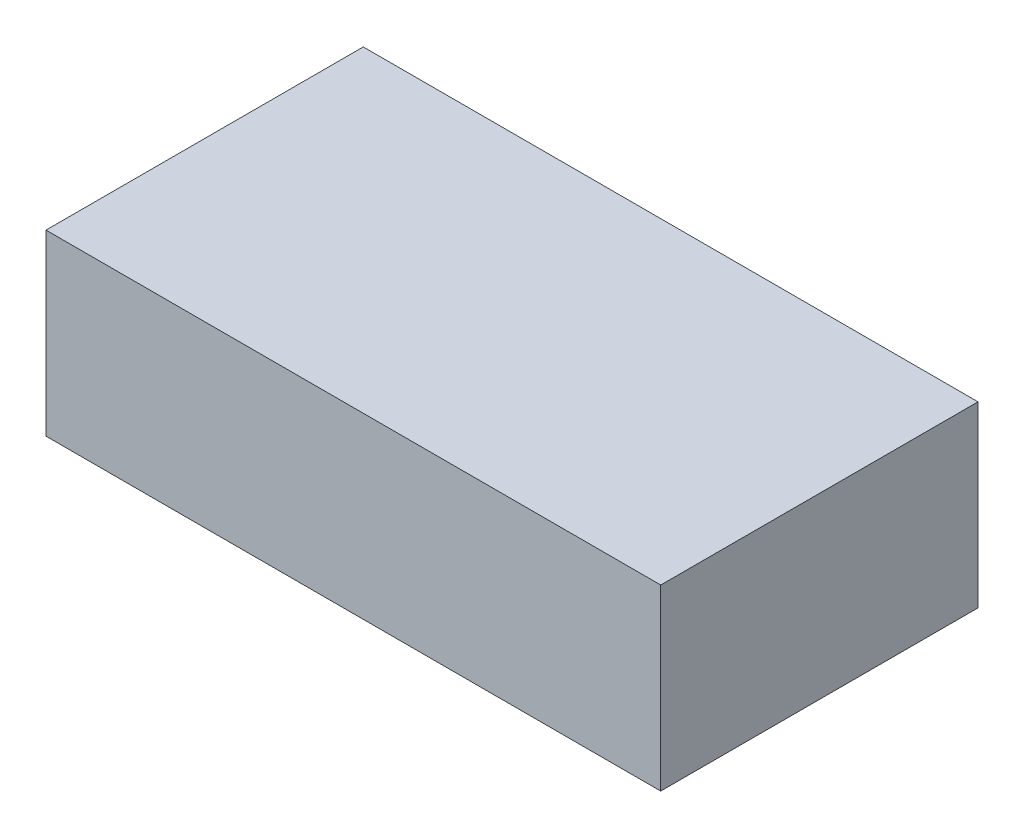
ISO-10303-21;
HEADER;
FILE_DESCRIPTION(('STEP AP214'),'2;1');
FILE_NAME('part.step','',(''),(''),'','','');
FILE_SCHEMA(('AUTOMOTIVE_DESIGN { 1 0 10303 214 1 1 1 1 }'));
ENDSEC;
DATA;
#1=APPLICATION_CONTEXT('core data for automotive mechanical design processes');
#2=APPLICATION_PROTOCOL_DEFINITION('international standard','automotive_design',2000,#1);
#3=PRODUCT_CONTEXT('',#1,'mechanical');
#4=PRODUCT('Part','Part','',(#3));
#5=PRODUCT_RELATED_PRODUCT_CATEGORY('part','',(#4));
#6=PRODUCT_DEFINITION_FORMATION('','',#4);
#7=PRODUCT_DEFINITION_CONTEXT('part definition',#1,'design');
#8=PRODUCT_DEFINITION('design','',#6,#7);
#9=PRODUCT_DEFINITION_SHAPE('','',#8);
#10=(LENGTH_UNIT() NAMED_UNIT(*) SI_UNIT(.MILLI.,.METRE.));
#11=(NAMED_UNIT(*) PLANE_ANGLE_UNIT() SI_UNIT($,.RADIAN.));
#12=(NAMED_UNIT(*) SI_UNIT($,.STERADIAN.) SOLID_ANGLE_UNIT());
#13=UNCERTAINTY_MEASURE_WITH_UNIT(LENGTH_MEASURE(1.E-05),#10,'distance_accuracy_value','');
#14=(GEOMETRIC_REPRESENTATION_CONTEXT(3) GLOBAL_UNCERTAINTY_ASSIGNED_CONTEXT((#13)) GLOBAL_UNIT_ASSIGNED_CONTEXT((#10,
#11,#12)) REPRESENTATION_CONTEXT('',''));
#15=CARTESIAN_POINT('',(0.,0.,0.));
#16=DIRECTION('',(0.,0.,1.));
#17=DIRECTION('',(1.,0.,0.));
#18=AXIS2_PLACEMENT_3D('',#15,#16,#17);
#19=CARTESIAN_POINT('',(-0.775,0.575,0.4));
#20=DIRECTION('',(0.,-1.,0.));
#21=DIRECTION('',(0.,0.,-1.));
#22=AXIS2_PLACEMENT_3D('',#19,#20,#21);
#23=PLANE('',#22);
#24=DIRECTION('',(1.,0.,0.));
#25=VECTOR('',#24,1.);
#26=CARTESIAN_POINT('',(-0.775,0.575,-0.4));
#27=LINE('',#26,#25);
#28=CARTESIAN_POINT('',(0.775,0.575,-0.4));
#29=VERTEX_POINT('',#28);
#30=CARTESIAN_POINT('',(-0.775,0.575,-0.4));
#31=VERTEX_POINT('',#30);
#32=EDGE_CURVE('E20',#29,#31,#27,.F.);
#33=ORIENTED_EDGE('',*,*,#32,.T.);
#34=DIRECTION('',(0.,0.,-1.));
#35=VECTOR('',#34,1.);
#36=CARTESIAN_POINT('',(-0.775,0.575,0.4));
#37=LINE('',#36,#35);
#38=CARTESIAN_POINT('',(-0.775,0.575,0.4));
#39=VERTEX_POINT('',#38);
#40=EDGE_CURVE('E55',#31,#39,#37,.F.);
#41=ORIENTED_EDGE('',*,*,#40,.T.);
#42=DIRECTION('',(-1.,0.,0.));
#43=VECTOR('',#42,1.);
#44=CARTESIAN_POINT('',(-0.775,0.575,0.4));
#45=LINE('',#44,#43);
#46=CARTESIAN_POINT('',(0.775,0.575,0.4));
#47=VERTEX_POINT('',#46);
#48=EDGE_CURVE('E74',#39,#47,#45,.F.);
#49=ORIENTED_EDGE('',*,*,#48,.T.);
#50=DIRECTION('',(0.,0.,-1.));
#51=VECTOR('',#50,1.);
#52=CARTESIAN_POINT('',(0.775,0.575,0.4));
#53=LINE('',#52,#51);
#54=EDGE_CURVE('E66',#29,#47,#53,.F.);
#55=ORIENTED_EDGE('',*,*,#54,.F.);
#56=EDGE_LOOP('',(#33,#41,#49,#55));
#57=FACE_BOUND('',#56,.T.);
#58=ADVANCED_FACE('F17',(#57),#23,.F.);
#59=CARTESIAN_POINT('',(-0.775,0.575,-0.4));
#60=DIRECTION('',(0.,0.,1.));
#61=DIRECTION('',(1.,0.,0.));
#62=AXIS2_PLACEMENT_3D('',#59,#60,#61);
#63=PLANE('',#62);
#64=DIRECTION('',(1.,0.,0.));
#65=VECTOR('',#64,1.);
#66=CARTESIAN_POINT('',(-0.775,0.125,-0.4));
#67=LINE('',#66,#65);
#68=CARTESIAN_POINT('',(0.775,0.125,-0.4));
#69=VERTEX_POINT('',#68);
#70=CARTESIAN_POINT('',(-0.775,0.125,-0.4));
#71=VERTEX_POINT('',#70);
#72=EDGE_CURVE('E72',#69,#71,#67,.F.);
#73=ORIENTED_EDGE('',*,*,#72,.T.);
#74=DIRECTION('',(0.,1.,0.));
#75=VECTOR('',#74,1.);
#76=CARTESIAN_POINT('',(-0.775,0.125,-0.4));
#77=LINE('',#76,#75);
#78=EDGE_CURVE('E62',#71,#31,#77,.T.);
#79=ORIENTED_EDGE('',*,*,#78,.T.);
#80=ORIENTED_EDGE('',*,*,#32,.F.);
#81=DIRECTION('',(0.,1.,0.));
#82=VECTOR('',#81,1.);
#83=CARTESIAN_POINT('',(0.775,0.125,-0.4));
#84=LINE('',#83,#82);
#85=EDGE_CURVE('E79',#69,#29,#84,.T.);
#86=ORIENTED_EDGE('',*,*,#85,.F.);
#87=EDGE_LOOP('',(#73,#79,#80,#86));
#88=FACE_BOUND('',#87,.T.);
#89=ADVANCED_FACE('F71',(#88),#63,.F.);
#90=CARTESIAN_POINT('',(-0.775,0.125,0.4));
#91=DIRECTION('',(1.,0.,0.));
#92=DIRECTION('',(0.,0.,-1.));
#93=AXIS2_PLACEMENT_3D('',#90,#91,#92);
#94=PLANE('',#93);
#95=DIRECTION('',(0.,0.,1.));
#96=VECTOR('',#95,1.);
#97=CARTESIAN_POINT('',(-0.775,0.125,-0.4));
#98=LINE('',#97,#96);
#99=CARTESIAN_POINT('',(-0.775,0.125,0.4));
#100=VERTEX_POINT('',#99);
#101=EDGE_CURVE('E83',#71,#100,#98,.T.);
#102=ORIENTED_EDGE('',*,*,#101,.T.);
#103=DIRECTION('',(0.,1.,0.));
#104=VECTOR('',#103,1.);
#105=CARTESIAN_POINT('',(-0.775,0.125,0.4));
#106=LINE('',#105,#104);
#107=EDGE_CURVE('E64',#100,#39,#106,.T.);
#108=ORIENTED_EDGE('',*,*,#107,.T.);
#109=ORIENTED_EDGE('',*,*,#40,.F.);
#110=ORIENTED_EDGE('',*,*,#78,.F.);
#111=EDGE_LOOP('',(#102,#108,#109,#110));
#112=FACE_BOUND('',#111,.T.);
#113=ADVANCED_FACE('F60',(#112),#94,.F.);
#114=CARTESIAN_POINT('',(-0.775,0.125,0.4));
#115=DIRECTION('',(0.,0.,-1.));
#116=DIRECTION('',(-1.,0.,0.));
#117=AXIS2_PLACEMENT_3D('',#114,#115,#116);
#118=PLANE('',#117);
#119=ORIENTED_EDGE('',*,*,#48,.F.);
#120=ORIENTED_EDGE('',*,*,#107,.F.);
#121=DIRECTION('',(1.,0.,0.));
#122=VECTOR('',#121,1.);
#123=CARTESIAN_POINT('',(-0.775,0.125,0.4));
#124=LINE('',#123,#122);
#125=CARTESIAN_POINT('',(0.775,0.125,0.4));
#126=VERTEX_POINT('',#125);
#127=EDGE_CURVE('E26',#100,#126,#124,.T.);
#128=ORIENTED_EDGE('',*,*,#127,.T.);
#129=DIRECTION('',(0.,1.,0.));
#130=VECTOR('',#129,1.);
#131=CARTESIAN_POINT('',(0.775,0.125,0.4));
#132=LINE('',#131,#130);
#133=EDGE_CURVE('E34',#47,#126,#132,.F.);
#134=ORIENTED_EDGE('',*,*,#133,.F.);
#135=EDGE_LOOP('',(#119,#120,#128,#134));
#136=FACE_BOUND('',#135,.T.);
#137=ADVANCED_FACE('F88',(#136),#118,.F.);
#138=CARTESIAN_POINT('',(0.775,0.125,0.4));
#139=DIRECTION('',(1.,0.,0.));
#140=DIRECTION('',(0.,0.,-1.));
#141=AXIS2_PLACEMENT_3D('',#138,#139,#140);
#142=PLANE('',#141);
#143=ORIENTED_EDGE('',*,*,#85,.T.);
#144=ORIENTED_EDGE('',*,*,#54,.T.);
#145=ORIENTED_EDGE('',*,*,#133,.T.);
#146=DIRECTION('',(0.,0.,1.));
#147=VECTOR('',#146,1.);
#148=CARTESIAN_POINT('',(0.775,0.125,-0.4));
#149=LINE('',#148,#147);
#150=EDGE_CURVE('E11',#126,#69,#149,.F.);
#151=ORIENTED_EDGE('',*,*,#150,.T.);
#152=EDGE_LOOP('',(#143,#144,#145,#151));
#153=FACE_BOUND('',#152,.T.);
#154=ADVANCED_FACE('F91',(#153),#142,.T.);
#155=CARTESIAN_POINT('',(-0.775,0.125,-0.4));
#156=DIRECTION('',(0.,1.,0.));
#157=DIRECTION('',(0.,0.,1.));
#158=AXIS2_PLACEMENT_3D('',#155,#156,#157);
#159=PLANE('',#158);
#160=ORIENTED_EDGE('',*,*,#127,.F.);
#161=ORIENTED_EDGE('',*,*,#101,.F.);
#162=ORIENTED_EDGE('',*,*,#72,.F.);
#163=ORIENTED_EDGE('',*,*,#150,.F.);
#164=EDGE_LOOP('',(#160,#161,#162,#163));
#165=FACE_BOUND('',#164,.T.);
#166=ADVANCED_FACE('F90',(#165),#159,.F.);
#167=CLOSED_SHELL('',(#58,#89,#113,#137,#154,#166));
#168=MANIFOLD_SOLID_BREP('B1',#167);
#169=ADVANCED_BREP_SHAPE_REPRESENTATION('',(#18,#168),#14);
#170=SHAPE_DEFINITION_REPRESENTATION(#9,#169);
ENDSEC;
END-ISO-10303-21;
